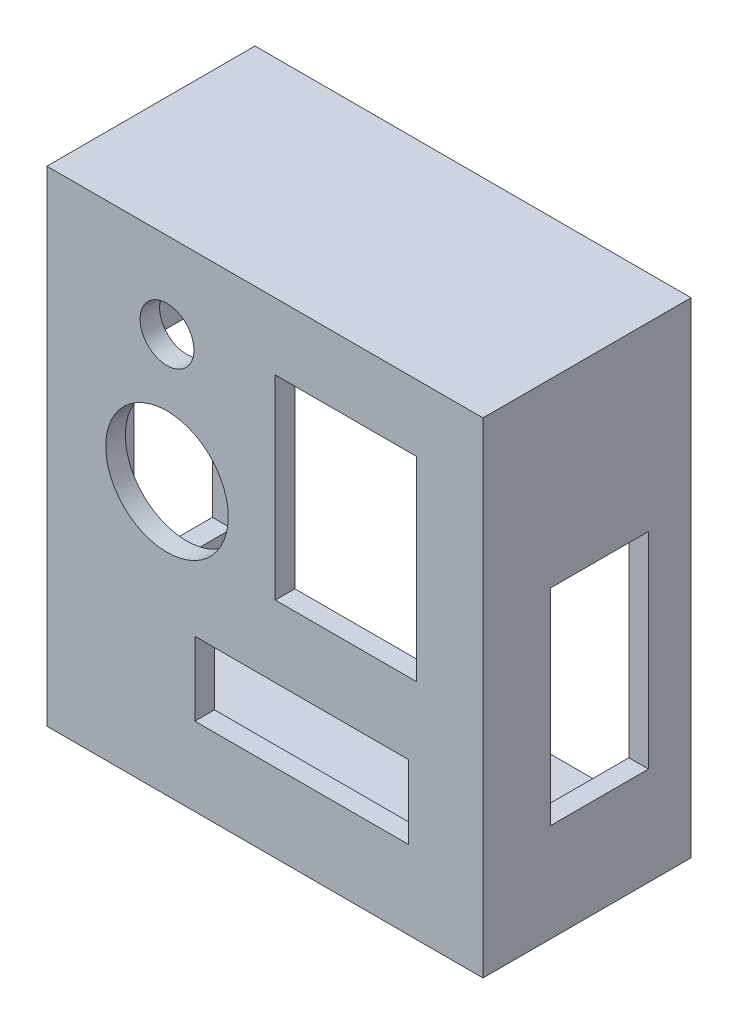
ISO-10303-21;
HEADER;
FILE_DESCRIPTION(('STEP AP214'),'2;1');
FILE_NAME('part.step','',(''),(''),'','','');
FILE_SCHEMA(('AUTOMOTIVE_DESIGN { 1 0 10303 214 1 1 1 1 }'));
ENDSEC;
DATA;
#1=APPLICATION_CONTEXT('core data for automotive mechanical design processes');
#2=APPLICATION_PROTOCOL_DEFINITION('international standard','automotive_design',2000,#1);
#3=PRODUCT_CONTEXT('',#1,'mechanical');
#4=PRODUCT('Part','Part','',(#3));
#5=PRODUCT_RELATED_PRODUCT_CATEGORY('part','',(#4));
#6=PRODUCT_DEFINITION_FORMATION('','',#4);
#7=PRODUCT_DEFINITION_CONTEXT('part definition',#1,'design');
#8=PRODUCT_DEFINITION('design','',#6,#7);
#9=PRODUCT_DEFINITION_SHAPE('','',#8);
#10=(LENGTH_UNIT() NAMED_UNIT(*) SI_UNIT(.MILLI.,.METRE.));
#11=(NAMED_UNIT(*) PLANE_ANGLE_UNIT() SI_UNIT($,.RADIAN.));
#12=(NAMED_UNIT(*) SI_UNIT($,.STERADIAN.) SOLID_ANGLE_UNIT());
#13=UNCERTAINTY_MEASURE_WITH_UNIT(LENGTH_MEASURE(1.E-05),#10,'distance_accuracy_value','');
#14=(GEOMETRIC_REPRESENTATION_CONTEXT(3) GLOBAL_UNCERTAINTY_ASSIGNED_CONTEXT((#13)) GLOBAL_UNIT_ASSIGNED_CONTEXT((#10,
#11,#12)) REPRESENTATION_CONTEXT('',''));
#15=CARTESIAN_POINT('',(0.,0.,0.));
#16=DIRECTION('',(0.,0.,1.));
#17=DIRECTION('',(1.,0.,0.));
#18=AXIS2_PLACEMENT_3D('',#15,#16,#17);
#19=CARTESIAN_POINT('',(-70.64375,-72.23125,-61.07176));
#20=DIRECTION('',(1.,0.,0.));
#21=DIRECTION('',(0.,0.,-1.));
#22=AXIS2_PLACEMENT_3D('',#19,#20,#21);
#23=PLANE('',#22);
#24=DIRECTION('',(0.,0.,-1.));
#25=VECTOR('',#24,1.);
#26=CARTESIAN_POINT('',(-70.64375,-46.76775,-15.52194));
#27=LINE('',#26,#25);
#28=CARTESIAN_POINT('',(-70.64375,-46.76775,-15.52194));
#29=VERTEX_POINT('',#28);
#30=CARTESIAN_POINT('',(-70.64375,-46.76775,-47.27194));
#31=VERTEX_POINT('',#30);
#32=EDGE_CURVE('E230',#29,#31,#27,.T.);
#33=ORIENTED_EDGE('',*,*,#32,.T.);
#34=DIRECTION('',(0.,1.,0.));
#35=VECTOR('',#34,1.);
#36=CARTESIAN_POINT('',(-70.64375,19.90725,-47.27194));
#37=LINE('',#36,#35);
#38=CARTESIAN_POINT('',(-70.64375,19.90725,-47.27194));
#39=VERTEX_POINT('',#38);
#40=EDGE_CURVE('E211',#31,#39,#37,.T.);
#41=ORIENTED_EDGE('',*,*,#40,.T.);
#42=DIRECTION('',(0.,0.,1.));
#43=VECTOR('',#42,1.);
#44=CARTESIAN_POINT('',(-70.64375,19.90725,-15.52194));
#45=LINE('',#44,#43);
#46=CARTESIAN_POINT('',(-70.64375,19.90725,-15.52194));
#47=VERTEX_POINT('',#46);
#48=EDGE_CURVE('E222',#39,#47,#45,.T.);
#49=ORIENTED_EDGE('',*,*,#48,.T.);
#50=DIRECTION('',(0.,-1.,0.));
#51=VECTOR('',#50,1.);
#52=CARTESIAN_POINT('',(-70.64375,19.90725,-15.52194));
#53=LINE('',#52,#51);
#54=EDGE_CURVE('E58',#47,#29,#53,.T.);
#55=ORIENTED_EDGE('',*,*,#54,.T.);
#56=EDGE_LOOP('',(#33,#41,#49,#55));
#57=FACE_BOUND('',#56,.T.);
#58=DIRECTION('',(0.,1.,0.));
#59=VECTOR('',#58,1.);
#60=CARTESIAN_POINT('',(-70.64375,-72.23125,6.35));
#61=LINE('',#60,#59);
#62=CARTESIAN_POINT('',(-70.64375,-78.58125,6.35));
#63=VERTEX_POINT('',#62);
#64=CARTESIAN_POINT('',(-70.64375,78.58125,6.35));
#65=VERTEX_POINT('',#64);
#66=EDGE_CURVE('E383',#63,#65,#61,.T.);
#67=ORIENTED_EDGE('',*,*,#66,.T.);
#68=DIRECTION('',(0.,0.,1.));
#69=VECTOR('',#68,1.);
#70=CARTESIAN_POINT('',(-70.64375,78.58125,-61.07176));
#71=LINE('',#70,#69);
#72=CARTESIAN_POINT('',(-70.64375,78.58125,-61.07176));
#73=VERTEX_POINT('',#72);
#74=EDGE_CURVE('E388',#73,#65,#71,.T.);
#75=ORIENTED_EDGE('',*,*,#74,.F.);
#76=DIRECTION('',(0.,1.,0.));
#77=VECTOR('',#76,1.);
#78=CARTESIAN_POINT('',(-70.64375,-72.23125,-61.07176));
#79=LINE('',#78,#77);
#80=CARTESIAN_POINT('',(-70.64375,-78.58125,-61.07176));
#81=VERTEX_POINT('',#80);
#82=EDGE_CURVE('E414',#81,#73,#79,.T.);
#83=ORIENTED_EDGE('',*,*,#82,.F.);
#84=DIRECTION('',(0.,0.,1.));
#85=VECTOR('',#84,1.);
#86=CARTESIAN_POINT('',(-70.64375,-78.58125,-61.07176));
#87=LINE('',#86,#85);
#88=EDGE_CURVE('E394',#81,#63,#87,.T.);
#89=ORIENTED_EDGE('',*,*,#88,.T.);
#90=EDGE_LOOP('',(#67,#75,#83,#89));
#91=FACE_BOUND('',#90,.T.);
#92=ADVANCED_FACE('F42',(#57,#91),#23,.F.);
#93=CARTESIAN_POINT('',(-64.29375,78.58125,-61.07176));
#94=DIRECTION('',(0.,-1.,0.));
#95=DIRECTION('',(0.,0.,-1.));
#96=AXIS2_PLACEMENT_3D('',#93,#94,#95);
#97=PLANE('',#96);
#98=DIRECTION('',(1.,0.,0.));
#99=VECTOR('',#98,1.);
#100=CARTESIAN_POINT('',(-64.29375,78.58125,6.35));
#101=LINE('',#100,#99);
#102=CARTESIAN_POINT('',(70.64375,78.58125,6.35));
#103=VERTEX_POINT('',#102);
#104=EDGE_CURVE('E387',#65,#103,#101,.T.);
#105=ORIENTED_EDGE('',*,*,#104,.T.);
#106=DIRECTION('',(0.,0.,1.));
#107=VECTOR('',#106,1.);
#108=CARTESIAN_POINT('',(70.64375,78.58125,-61.07176));
#109=LINE('',#108,#107);
#110=CARTESIAN_POINT('',(70.64375,78.58125,-61.07176));
#111=VERTEX_POINT('',#110);
#112=EDGE_CURVE('E393',#111,#103,#109,.T.);
#113=ORIENTED_EDGE('',*,*,#112,.F.);
#114=DIRECTION('',(1.,0.,0.));
#115=VECTOR('',#114,1.);
#116=CARTESIAN_POINT('',(-64.29375,78.58125,-61.07176));
#117=LINE('',#116,#115);
#118=EDGE_CURVE('E418',#73,#111,#117,.T.);
#119=ORIENTED_EDGE('',*,*,#118,.F.);
#120=ORIENTED_EDGE('',*,*,#74,.T.);
#121=EDGE_LOOP('',(#105,#113,#119,#120));
#122=FACE_BOUND('',#121,.T.);
#123=ADVANCED_FACE('F492',(#122),#97,.F.);
#124=CARTESIAN_POINT('',(70.64375,-72.23125,-61.07176));
#125=DIRECTION('',(1.,0.,0.));
#126=DIRECTION('',(0.,0.,-1.));
#127=AXIS2_PLACEMENT_3D('',#124,#125,#126);
#128=PLANE('',#127);
#129=DIRECTION('',(0.,1.,0.));
#130=VECTOR('',#129,1.);
#131=CARTESIAN_POINT('',(70.64375,19.90725,-47.27194));
#132=LINE('',#131,#130);
#133=CARTESIAN_POINT('',(70.64375,-46.76775,-47.27194));
#134=VERTEX_POINT('',#133);
#135=CARTESIAN_POINT('',(70.64375,19.90725,-47.27194));
#136=VERTEX_POINT('',#135);
#137=EDGE_CURVE('E66',#134,#136,#132,.T.);
#138=ORIENTED_EDGE('',*,*,#137,.F.);
#139=DIRECTION('',(0.,0.,-1.));
#140=VECTOR('',#139,1.);
#141=CARTESIAN_POINT('',(70.64375,-46.76775,-15.52194));
#142=LINE('',#141,#140);
#143=CARTESIAN_POINT('',(70.64375,-46.76775,-15.52194));
#144=VERTEX_POINT('',#143);
#145=EDGE_CURVE('E232',#144,#134,#142,.T.);
#146=ORIENTED_EDGE('',*,*,#145,.F.);
#147=DIRECTION('',(0.,-1.,0.));
#148=VECTOR('',#147,1.);
#149=CARTESIAN_POINT('',(70.64375,19.90725,-15.52194));
#150=LINE('',#149,#148);
#151=CARTESIAN_POINT('',(70.64375,19.90725,-15.52194));
#152=VERTEX_POINT('',#151);
#153=EDGE_CURVE('E236',#152,#144,#150,.T.);
#154=ORIENTED_EDGE('',*,*,#153,.F.);
#155=DIRECTION('',(0.,0.,1.));
#156=VECTOR('',#155,1.);
#157=CARTESIAN_POINT('',(70.64375,19.90725,-15.52194));
#158=LINE('',#157,#156);
#159=EDGE_CURVE('E245',#136,#152,#158,.T.);
#160=ORIENTED_EDGE('',*,*,#159,.F.);
#161=EDGE_LOOP('',(#138,#146,#154,#160));
#162=FACE_BOUND('',#161,.T.);
#163=DIRECTION('',(0.,1.,0.));
#164=VECTOR('',#163,1.);
#165=CARTESIAN_POINT('',(70.64375,-72.23125,6.35));
#166=LINE('',#165,#164);
#167=CARTESIAN_POINT('',(70.64375,-78.58125,6.35));
#168=VERTEX_POINT('',#167);
#169=EDGE_CURVE('E402',#168,#103,#166,.T.);
#170=ORIENTED_EDGE('',*,*,#169,.F.);
#171=DIRECTION('',(0.,0.,1.));
#172=VECTOR('',#171,1.);
#173=CARTESIAN_POINT('',(70.64375,-78.58125,-61.07176));
#174=LINE('',#173,#172);
#175=CARTESIAN_POINT('',(70.64375,-78.58125,-61.07176));
#176=VERTEX_POINT('',#175);
#177=EDGE_CURVE('E397',#176,#168,#174,.T.);
#178=ORIENTED_EDGE('',*,*,#177,.F.);
#179=DIRECTION('',(0.,1.,0.));
#180=VECTOR('',#179,1.);
#181=CARTESIAN_POINT('',(70.64375,-72.23125,-61.07176));
#182=LINE('',#181,#180);
#183=EDGE_CURVE('E421',#176,#111,#182,.T.);
#184=ORIENTED_EDGE('',*,*,#183,.T.);
#185=ORIENTED_EDGE('',*,*,#112,.T.);
#186=EDGE_LOOP('',(#170,#178,#184,#185));
#187=FACE_BOUND('',#186,.T.);
#188=ADVANCED_FACE('F488',(#162,#187),#128,.T.);
#189=CARTESIAN_POINT('',(-64.29375,-78.58125,-61.07176));
#190=DIRECTION('',(0.,-1.,0.));
#191=DIRECTION('',(0.,0.,-1.));
#192=AXIS2_PLACEMENT_3D('',#189,#190,#191);
#193=PLANE('',#192);
#194=DIRECTION('',(1.,0.,0.));
#195=VECTOR('',#194,1.);
#196=CARTESIAN_POINT('',(-64.29375,-78.58125,6.35));
#197=LINE('',#196,#195);
#198=EDGE_CURVE('E408',#63,#168,#197,.T.);
#199=ORIENTED_EDGE('',*,*,#198,.F.);
#200=ORIENTED_EDGE('',*,*,#88,.F.);
#201=DIRECTION('',(1.,0.,0.));
#202=VECTOR('',#201,1.);
#203=CARTESIAN_POINT('',(-64.29375,-78.58125,-61.07176));
#204=LINE('',#203,#202);
#205=EDGE_CURVE('E398',#81,#176,#204,.T.);
#206=ORIENTED_EDGE('',*,*,#205,.T.);
#207=ORIENTED_EDGE('',*,*,#177,.T.);
#208=EDGE_LOOP('',(#199,#200,#206,#207));
#209=FACE_BOUND('',#208,.T.);
#210=ADVANCED_FACE('F491',(#209),#193,.T.);
#211=CARTESIAN_POINT('',(0.,0.,-61.07176));
#212=DIRECTION('',(0.,0.,-1.));
#213=DIRECTION('',(-1.,0.,0.));
#214=AXIS2_PLACEMENT_3D('',#211,#212,#213);
#215=PLANE('',#214);
#216=DIRECTION('',(0.,1.,0.));
#217=VECTOR('',#216,1.);
#218=CARTESIAN_POINT('',(-64.29375,-72.23125,-61.07176));
#219=LINE('',#218,#217);
#220=CARTESIAN_POINT('',(-64.29375,-72.23125,-61.07176));
#221=VERTEX_POINT('',#220);
#222=CARTESIAN_POINT('',(-64.29375,72.23125,-61.07176));
#223=VERTEX_POINT('',#222);
#224=EDGE_CURVE('E339',#221,#223,#219,.T.);
#225=ORIENTED_EDGE('',*,*,#224,.F.);
#226=DIRECTION('',(1.,0.,0.));
#227=VECTOR('',#226,1.);
#228=CARTESIAN_POINT('',(-64.29375,-72.23125,-61.07176));
#229=LINE('',#228,#227);
#230=CARTESIAN_POINT('',(64.29375,-72.23125,-61.07176));
#231=VERTEX_POINT('',#230);
#232=EDGE_CURVE('E350',#221,#231,#229,.T.);
#233=ORIENTED_EDGE('',*,*,#232,.T.);
#234=DIRECTION('',(0.,1.,0.));
#235=VECTOR('',#234,1.);
#236=CARTESIAN_POINT('',(64.29375,-72.23125,-61.07176));
#237=LINE('',#236,#235);
#238=CARTESIAN_POINT('',(64.29375,72.23125,-61.07176));
#239=VERTEX_POINT('',#238);
#240=EDGE_CURVE('E346',#231,#239,#237,.T.);
#241=ORIENTED_EDGE('',*,*,#240,.T.);
#242=DIRECTION('',(1.,0.,0.));
#243=VECTOR('',#242,1.);
#244=CARTESIAN_POINT('',(-64.29375,72.23125,-61.07176));
#245=LINE('',#244,#243);
#246=EDGE_CURVE('E342',#223,#239,#245,.T.);
#247=ORIENTED_EDGE('',*,*,#246,.F.);
#248=EDGE_LOOP('',(#225,#233,#241,#247));
#249=FACE_BOUND('',#248,.T.);
#250=ORIENTED_EDGE('',*,*,#82,.T.);
#251=ORIENTED_EDGE('',*,*,#118,.T.);
#252=ORIENTED_EDGE('',*,*,#183,.F.);
#253=ORIENTED_EDGE('',*,*,#205,.F.);
#254=EDGE_LOOP('',(#250,#251,#252,#253));
#255=FACE_BOUND('',#254,.T.);
#256=ADVANCED_FACE('F504',(#249,#255),#215,.T.);
#257=CARTESIAN_POINT('',(0.,0.,6.35));
#258=DIRECTION('',(0.,0.,-1.));
#259=DIRECTION('',(-1.,0.,0.));
#260=AXIS2_PLACEMENT_3D('',#257,#258,#259);
#261=PLANE('',#260);
#262=DIRECTION('',(-1.,0.,0.));
#263=VECTOR('',#262,1.);
#264=CARTESIAN_POINT('',(-22.70125,-29.36875,6.35));
#265=LINE('',#264,#263);
#266=CARTESIAN_POINT('',(46.51375,-29.36875,6.35));
#267=VERTEX_POINT('',#266);
#268=CARTESIAN_POINT('',(-22.70125,-29.36875,6.35));
#269=VERTEX_POINT('',#268);
#270=EDGE_CURVE('E329',#267,#269,#265,.T.);
#271=ORIENTED_EDGE('',*,*,#270,.F.);
#272=DIRECTION('',(0.,1.,0.));
#273=VECTOR('',#272,1.);
#274=CARTESIAN_POINT('',(46.51375,-29.36875,6.35));
#275=LINE('',#274,#273);
#276=CARTESIAN_POINT('',(46.51375,-53.18125,6.35));
#277=VERTEX_POINT('',#276);
#278=EDGE_CURVE('E295',#277,#267,#275,.T.);
#279=ORIENTED_EDGE('',*,*,#278,.F.);
#280=DIRECTION('',(1.,0.,0.));
#281=VECTOR('',#280,1.);
#282=CARTESIAN_POINT('',(-22.70125,-53.18125,6.35));
#283=LINE('',#282,#281);
#284=CARTESIAN_POINT('',(-22.70125,-53.18125,6.35));
#285=VERTEX_POINT('',#284);
#286=EDGE_CURVE('E313',#285,#277,#283,.T.);
#287=ORIENTED_EDGE('',*,*,#286,.F.);
#288=DIRECTION('',(0.,-1.,0.));
#289=VECTOR('',#288,1.);
#290=CARTESIAN_POINT('',(-22.70125,-29.36875,6.35));
#291=LINE('',#290,#289);
#292=EDGE_CURVE('E325',#269,#285,#291,.T.);
#293=ORIENTED_EDGE('',*,*,#292,.F.);
#294=EDGE_LOOP('',(#271,#279,#287,#293));
#295=FACE_BOUND('',#294,.T.);
#296=DIRECTION('',(-1.,0.,0.));
#297=VECTOR('',#296,1.);
#298=CARTESIAN_POINT('',(3.33374999999998,56.99125,6.35));
#299=LINE('',#298,#297);
#300=CARTESIAN_POINT('',(49.05375,56.99125,6.35));
#301=VERTEX_POINT('',#300);
#302=CARTESIAN_POINT('',(3.33374999999998,56.99125,6.35));
#303=VERTEX_POINT('',#302);
#304=EDGE_CURVE('E303',#301,#303,#299,.T.);
#305=ORIENTED_EDGE('',*,*,#304,.F.);
#306=DIRECTION('',(0.,1.,0.));
#307=VECTOR('',#306,1.);
#308=CARTESIAN_POINT('',(49.05375,56.99125,6.35));
#309=LINE('',#308,#307);
#310=CARTESIAN_POINT('',(49.05375,-6.19125,6.35));
#311=VERTEX_POINT('',#310);
#312=EDGE_CURVE('E280',#311,#301,#309,.T.);
#313=ORIENTED_EDGE('',*,*,#312,.F.);
#314=DIRECTION('',(1.,0.,0.));
#315=VECTOR('',#314,1.);
#316=CARTESIAN_POINT('',(3.33374999999999,-6.19125,6.35));
#317=LINE('',#316,#315);
#318=CARTESIAN_POINT('',(3.33374999999999,-6.19125,6.35));
#319=VERTEX_POINT('',#318);
#320=EDGE_CURVE('E285',#319,#311,#317,.T.);
#321=ORIENTED_EDGE('',*,*,#320,.F.);
#322=DIRECTION('',(0.,-1.,0.));
#323=VECTOR('',#322,1.);
#324=CARTESIAN_POINT('',(3.33374999999998,56.99125,6.35));
#325=LINE('',#324,#323);
#326=EDGE_CURVE('E299',#303,#319,#325,.T.);
#327=ORIENTED_EDGE('',*,*,#326,.F.);
#328=EDGE_LOOP('',(#305,#313,#321,#327));
#329=FACE_BOUND('',#328,.T.);
#330=CARTESIAN_POINT('',(-31.75,9.52499999999999,6.35));
#331=DIRECTION('',(0.,0.,1.));
#332=DIRECTION('',(1.,0.,0.));
#333=AXIS2_PLACEMENT_3D('',#330,#331,#332);
#334=CIRCLE('',#333,19.84375);
#335=CARTESIAN_POINT('',(-11.90625,9.52499999999999,6.34999999999999));
#336=VERTEX_POINT('',#335);
#337=EDGE_CURVE('E275',#336,#336,#334,.T.);
#338=ORIENTED_EDGE('',*,*,#337,.F.);
#339=EDGE_LOOP('',(#338));
#340=FACE_BOUND('',#339,.T.);
#341=CARTESIAN_POINT('',(-31.75,50.8,6.35));
#342=DIRECTION('',(0.,0.,1.));
#343=DIRECTION('',(1.,0.,0.));
#344=AXIS2_PLACEMENT_3D('',#341,#342,#343);
#345=CIRCLE('',#344,8.73124999999999);
#346=CARTESIAN_POINT('',(-23.01875,50.8,6.34999999999999));
#347=VERTEX_POINT('',#346);
#348=EDGE_CURVE('E279',#347,#347,#345,.T.);
#349=ORIENTED_EDGE('',*,*,#348,.F.);
#350=EDGE_LOOP('',(#349));
#351=FACE_BOUND('',#350,.T.);
#352=ORIENTED_EDGE('',*,*,#66,.F.);
#353=ORIENTED_EDGE('',*,*,#198,.T.);
#354=ORIENTED_EDGE('',*,*,#169,.T.);
#355=ORIENTED_EDGE('',*,*,#104,.F.);
#356=EDGE_LOOP('',(#352,#353,#354,#355));
#357=FACE_BOUND('',#356,.T.);
#358=ADVANCED_FACE('F44',(#295,#329,#340,#351,#357),#261,.F.);
#359=CARTESIAN_POINT('',(-64.29375,-72.23125,-61.07176));
#360=DIRECTION('',(1.,0.,0.));
#361=DIRECTION('',(0.,0.,-1.));
#362=AXIS2_PLACEMENT_3D('',#359,#360,#361);
#363=PLANE('',#362);
#364=DIRECTION('',(0.,1.,0.));
#365=VECTOR('',#364,1.);
#366=CARTESIAN_POINT('',(-64.29375,-72.23125,-47.27194));
#367=LINE('',#366,#365);
#368=CARTESIAN_POINT('',(-64.29375,-46.76775,-47.27194));
#369=VERTEX_POINT('',#368);
#370=CARTESIAN_POINT('',(-64.29375,19.90725,-47.27194));
#371=VERTEX_POINT('',#370);
#372=EDGE_CURVE('E214',#369,#371,#367,.T.);
#373=ORIENTED_EDGE('',*,*,#372,.F.);
#374=DIRECTION('',(0.,0.,-1.));
#375=VECTOR('',#374,1.);
#376=CARTESIAN_POINT('',(-64.29375,-46.76775,-61.07176));
#377=LINE('',#376,#375);
#378=CARTESIAN_POINT('',(-64.29375,-46.76775,-15.52194));
#379=VERTEX_POINT('',#378);
#380=EDGE_CURVE('E269',#379,#369,#377,.T.);
#381=ORIENTED_EDGE('',*,*,#380,.F.);
#382=DIRECTION('',(0.,-1.,0.));
#383=VECTOR('',#382,1.);
#384=CARTESIAN_POINT('',(-64.29375,-72.23125,-15.52194));
#385=LINE('',#384,#383);
#386=CARTESIAN_POINT('',(-64.29375,19.90725,-15.52194));
#387=VERTEX_POINT('',#386);
#388=EDGE_CURVE('E266',#387,#379,#385,.T.);
#389=ORIENTED_EDGE('',*,*,#388,.F.);
#390=DIRECTION('',(0.,0.,1.));
#391=VECTOR('',#390,1.);
#392=CARTESIAN_POINT('',(-64.29375,19.90725,-61.07176));
#393=LINE('',#392,#391);
#394=EDGE_CURVE('E255',#371,#387,#393,.T.);
#395=ORIENTED_EDGE('',*,*,#394,.F.);
#396=EDGE_LOOP('',(#373,#381,#389,#395));
#397=FACE_BOUND('',#396,.T.);
#398=DIRECTION('',(0.,1.,0.));
#399=VECTOR('',#398,1.);
#400=CARTESIAN_POINT('',(-64.29375,-72.23125,0.));
#401=LINE('',#400,#399);
#402=CARTESIAN_POINT('',(-64.29375,-72.23125,0.));
#403=VERTEX_POINT('',#402);
#404=CARTESIAN_POINT('',(-64.29375,72.23125,0.));
#405=VERTEX_POINT('',#404);
#406=EDGE_CURVE('E355',#403,#405,#401,.T.);
#407=ORIENTED_EDGE('',*,*,#406,.F.);
#408=DIRECTION('',(0.,0.,1.));
#409=VECTOR('',#408,1.);
#410=CARTESIAN_POINT('',(-64.29375,-72.23125,-61.07176));
#411=LINE('',#410,#409);
#412=EDGE_CURVE('E354',#221,#403,#411,.T.);
#413=ORIENTED_EDGE('',*,*,#412,.F.);
#414=ORIENTED_EDGE('',*,*,#224,.T.);
#415=DIRECTION('',(0.,0.,1.));
#416=VECTOR('',#415,1.);
#417=CARTESIAN_POINT('',(-64.29375,72.23125,-61.07176));
#418=LINE('',#417,#416);
#419=EDGE_CURVE('E379',#223,#405,#418,.T.);
#420=ORIENTED_EDGE('',*,*,#419,.T.);
#421=EDGE_LOOP('',(#407,#413,#414,#420));
#422=FACE_BOUND('',#421,.T.);
#423=ADVANCED_FACE('F523',(#397,#422),#363,.T.);
#424=CARTESIAN_POINT('',(-64.29375,72.23125,-61.07176));
#425=DIRECTION('',(0.,-1.,0.));
#426=DIRECTION('',(0.,0.,-1.));
#427=AXIS2_PLACEMENT_3D('',#424,#425,#426);
#428=PLANE('',#427);
#429=DIRECTION('',(1.,0.,0.));
#430=VECTOR('',#429,1.);
#431=CARTESIAN_POINT('',(-64.29375,72.23125,0.));
#432=LINE('',#431,#430);
#433=CARTESIAN_POINT('',(64.29375,72.23125,0.));
#434=VERTEX_POINT('',#433);
#435=EDGE_CURVE('E359',#405,#434,#432,.T.);
#436=ORIENTED_EDGE('',*,*,#435,.F.);
#437=ORIENTED_EDGE('',*,*,#419,.F.);
#438=ORIENTED_EDGE('',*,*,#246,.T.);
#439=DIRECTION('',(0.,0.,1.));
#440=VECTOR('',#439,1.);
#441=CARTESIAN_POINT('',(64.29375,72.23125,-61.07176));
#442=LINE('',#441,#440);
#443=EDGE_CURVE('E376',#239,#434,#442,.T.);
#444=ORIENTED_EDGE('',*,*,#443,.T.);
#445=EDGE_LOOP('',(#436,#437,#438,#444));
#446=FACE_BOUND('',#445,.T.);
#447=ADVANCED_FACE('F532',(#446),#428,.T.);
#448=CARTESIAN_POINT('',(64.29375,-72.23125,-61.07176));
#449=DIRECTION('',(1.,0.,0.));
#450=DIRECTION('',(0.,0.,-1.));
#451=AXIS2_PLACEMENT_3D('',#448,#449,#450);
#452=PLANE('',#451);
#453=DIRECTION('',(0.,0.,-1.));
#454=VECTOR('',#453,1.);
#455=CARTESIAN_POINT('',(64.29375,-46.76775,-61.07176));
#456=LINE('',#455,#454);
#457=CARTESIAN_POINT('',(64.29375,-46.76775,-15.52194));
#458=VERTEX_POINT('',#457);
#459=CARTESIAN_POINT('',(64.29375,-46.76775,-47.27194));
#460=VERTEX_POINT('',#459);
#461=EDGE_CURVE('E51',#458,#460,#456,.T.);
#462=ORIENTED_EDGE('',*,*,#461,.T.);
#463=DIRECTION('',(0.,1.,0.));
#464=VECTOR('',#463,1.);
#465=CARTESIAN_POINT('',(64.29375,-72.23125,-47.27194));
#466=LINE('',#465,#464);
#467=CARTESIAN_POINT('',(64.29375,19.90725,-47.27194));
#468=VERTEX_POINT('',#467);
#469=EDGE_CURVE('E11',#460,#468,#466,.T.);
#470=ORIENTED_EDGE('',*,*,#469,.T.);
#471=DIRECTION('',(0.,0.,1.));
#472=VECTOR('',#471,1.);
#473=CARTESIAN_POINT('',(64.29375,19.90725,-61.07176));
#474=LINE('',#473,#472);
#475=CARTESIAN_POINT('',(64.29375,19.90725,-15.52194));
#476=VERTEX_POINT('',#475);
#477=EDGE_CURVE('E459',#468,#476,#474,.T.);
#478=ORIENTED_EDGE('',*,*,#477,.T.);
#479=DIRECTION('',(0.,-1.,0.));
#480=VECTOR('',#479,1.);
#481=CARTESIAN_POINT('',(64.29375,-72.23125,-15.52194));
#482=LINE('',#481,#480);
#483=EDGE_CURVE('E463',#476,#458,#482,.T.);
#484=ORIENTED_EDGE('',*,*,#483,.T.);
#485=EDGE_LOOP('',(#462,#470,#478,#484));
#486=FACE_BOUND('',#485,.T.);
#487=DIRECTION('',(0.,1.,0.));
#488=VECTOR('',#487,1.);
#489=CARTESIAN_POINT('',(64.29375,-72.23125,0.));
#490=LINE('',#489,#488);
#491=CARTESIAN_POINT('',(64.29375,-72.23125,0.));
#492=VERTEX_POINT('',#491);
#493=EDGE_CURVE('E364',#492,#434,#490,.T.);
#494=ORIENTED_EDGE('',*,*,#493,.T.);
#495=ORIENTED_EDGE('',*,*,#443,.F.);
#496=ORIENTED_EDGE('',*,*,#240,.F.);
#497=DIRECTION('',(0.,0.,1.));
#498=VECTOR('',#497,1.);
#499=CARTESIAN_POINT('',(64.29375,-72.23125,-61.07176));
#500=LINE('',#499,#498);
#501=EDGE_CURVE('E373',#231,#492,#500,.T.);
#502=ORIENTED_EDGE('',*,*,#501,.T.);
#503=EDGE_LOOP('',(#494,#495,#496,#502));
#504=FACE_BOUND('',#503,.T.);
#505=ADVANCED_FACE('F469',(#486,#504),#452,.F.);
#506=CARTESIAN_POINT('',(-64.29375,-72.23125,-61.07176));
#507=DIRECTION('',(0.,-1.,0.));
#508=DIRECTION('',(0.,0.,-1.));
#509=AXIS2_PLACEMENT_3D('',#506,#507,#508);
#510=PLANE('',#509);
#511=DIRECTION('',(1.,0.,0.));
#512=VECTOR('',#511,1.);
#513=CARTESIAN_POINT('',(-64.29375,-72.23125,0.));
#514=LINE('',#513,#512);
#515=EDGE_CURVE('E343',#403,#492,#514,.T.);
#516=ORIENTED_EDGE('',*,*,#515,.T.);
#517=ORIENTED_EDGE('',*,*,#501,.F.);
#518=ORIENTED_EDGE('',*,*,#232,.F.);
#519=ORIENTED_EDGE('',*,*,#412,.T.);
#520=EDGE_LOOP('',(#516,#517,#518,#519));
#521=FACE_BOUND('',#520,.T.);
#522=ADVANCED_FACE('F540',(#521),#510,.F.);
#523=CARTESIAN_POINT('',(0.,0.,0.));
#524=DIRECTION('',(0.,0.,-1.));
#525=DIRECTION('',(-1.,0.,0.));
#526=AXIS2_PLACEMENT_3D('',#523,#524,#525);
#527=PLANE('',#526);
#528=DIRECTION('',(0.,-1.,0.));
#529=VECTOR('',#528,1.);
#530=CARTESIAN_POINT('',(46.51375,0.,0.));
#531=LINE('',#530,#529);
#532=CARTESIAN_POINT('',(46.51375,-29.36875,0.));
#533=VERTEX_POINT('',#532);
#534=CARTESIAN_POINT('',(46.51375,-53.18125,0.));
#535=VERTEX_POINT('',#534);
#536=EDGE_CURVE('E456',#533,#535,#531,.T.);
#537=ORIENTED_EDGE('',*,*,#536,.F.);
#538=DIRECTION('',(1.,0.,0.));
#539=VECTOR('',#538,1.);
#540=CARTESIAN_POINT('',(0.,-29.36875,0.));
#541=LINE('',#540,#539);
#542=CARTESIAN_POINT('',(-22.70125,-29.36875,0.));
#543=VERTEX_POINT('',#542);
#544=EDGE_CURVE('E446',#543,#533,#541,.T.);
#545=ORIENTED_EDGE('',*,*,#544,.F.);
#546=DIRECTION('',(0.,1.,0.));
#547=VECTOR('',#546,1.);
#548=CARTESIAN_POINT('',(-22.70125,0.,0.));
#549=LINE('',#548,#547);
#550=CARTESIAN_POINT('',(-22.70125,-53.18125,0.));
#551=VERTEX_POINT('',#550);
#552=EDGE_CURVE('E449',#551,#543,#549,.T.);
#553=ORIENTED_EDGE('',*,*,#552,.F.);
#554=DIRECTION('',(-1.,0.,0.));
#555=VECTOR('',#554,1.);
#556=CARTESIAN_POINT('',(0.,-53.18125,0.));
#557=LINE('',#556,#555);
#558=EDGE_CURVE('E453',#535,#551,#557,.T.);
#559=ORIENTED_EDGE('',*,*,#558,.F.);
#560=EDGE_LOOP('',(#537,#545,#553,#559));
#561=FACE_BOUND('',#560,.T.);
#562=DIRECTION('',(0.,-1.,0.));
#563=VECTOR('',#562,1.);
#564=CARTESIAN_POINT('',(49.05375,0.,0.));
#565=LINE('',#564,#563);
#566=CARTESIAN_POINT('',(49.05375,56.99125,0.));
#567=VERTEX_POINT('',#566);
#568=CARTESIAN_POINT('',(49.05375,-6.19125,0.));
#569=VERTEX_POINT('',#568);
#570=EDGE_CURVE('E443',#567,#569,#565,.T.);
#571=ORIENTED_EDGE('',*,*,#570,.F.);
#572=DIRECTION('',(1.,0.,0.));
#573=VECTOR('',#572,1.);
#574=CARTESIAN_POINT('',(0.,56.99125,0.));
#575=LINE('',#574,#573);
#576=CARTESIAN_POINT('',(3.33374999999998,56.99125,0.));
#577=VERTEX_POINT('',#576);
#578=EDGE_CURVE('E392',#577,#567,#575,.T.);
#579=ORIENTED_EDGE('',*,*,#578,.F.);
#580=DIRECTION('',(0.,1.,0.));
#581=VECTOR('',#580,1.);
#582=CARTESIAN_POINT('',(3.33374999999999,0.,0.));
#583=LINE('',#582,#581);
#584=CARTESIAN_POINT('',(3.33374999999999,-6.19125,0.));
#585=VERTEX_POINT('',#584);
#586=EDGE_CURVE('E436',#585,#577,#583,.T.);
#587=ORIENTED_EDGE('',*,*,#586,.F.);
#588=DIRECTION('',(-1.,0.,0.));
#589=VECTOR('',#588,1.);
#590=CARTESIAN_POINT('',(0.,-6.19125,0.));
#591=LINE('',#590,#589);
#592=EDGE_CURVE('E440',#569,#585,#591,.T.);
#593=ORIENTED_EDGE('',*,*,#592,.F.);
#594=EDGE_LOOP('',(#571,#579,#587,#593));
#595=FACE_BOUND('',#594,.T.);
#596=CARTESIAN_POINT('',(-31.75,9.52499999999999,0.));
#597=DIRECTION('',(0.,0.,-1.));
#598=DIRECTION('',(-1.,0.,0.));
#599=AXIS2_PLACEMENT_3D('',#596,#597,#598);
#600=CIRCLE('',#599,19.84375);
#601=CARTESIAN_POINT('',(-11.90625,9.52499999999999,0.));
#602=VERTEX_POINT('',#601);
#603=EDGE_CURVE('E360',#602,#602,#600,.T.);
#604=ORIENTED_EDGE('',*,*,#603,.F.);
#605=EDGE_LOOP('',(#604));
#606=FACE_BOUND('',#605,.T.);
#607=CARTESIAN_POINT('',(-31.75,50.8,0.));
#608=DIRECTION('',(0.,0.,-1.));
#609=DIRECTION('',(-1.,0.,0.));
#610=AXIS2_PLACEMENT_3D('',#607,#608,#609);
#611=CIRCLE('',#610,8.73124999999999);
#612=CARTESIAN_POINT('',(-23.01875,50.8,0.));
#613=VERTEX_POINT('',#612);
#614=EDGE_CURVE('E338',#613,#613,#611,.T.);
#615=ORIENTED_EDGE('',*,*,#614,.F.);
#616=EDGE_LOOP('',(#615));
#617=FACE_BOUND('',#616,.T.);
#618=ORIENTED_EDGE('',*,*,#406,.T.);
#619=ORIENTED_EDGE('',*,*,#435,.T.);
#620=ORIENTED_EDGE('',*,*,#493,.F.);
#621=ORIENTED_EDGE('',*,*,#515,.F.);
#622=EDGE_LOOP('',(#618,#619,#620,#621));
#623=FACE_BOUND('',#622,.T.);
#624=ADVANCED_FACE('F536',(#561,#595,#606,#617,#623),#527,.T.);
#625=CARTESIAN_POINT('',(-31.75,50.8,-61.07176));
#626=DIRECTION('',(0.,0.,1.));
#627=DIRECTION('',(1.,0.,0.));
#628=AXIS2_PLACEMENT_3D('',#625,#626,#627);
#629=CYLINDRICAL_SURFACE('',#628,8.73124999999999);
#630=CARTESIAN_POINT('',(-23.01875,50.8,0.));
#631=CARTESIAN_POINT('',(-23.01875,50.8,0.0661458333333341));
#632=CARTESIAN_POINT('',(-23.01875,50.8,0.132291666666668));
#633=CARTESIAN_POINT('',(-23.01875,50.8,0.264583333333334));
#634=CARTESIAN_POINT('',(-23.01875,50.8,0.330729166666666));
#635=CARTESIAN_POINT('',(-23.01875,50.8,0.463020833333332));
#636=CARTESIAN_POINT('',(-23.01875,50.8,0.529166666666666));
#637=CARTESIAN_POINT('',(-23.01875,50.8,0.661458333333332));
#638=CARTESIAN_POINT('',(-23.01875,50.8,0.727604166666664));
#639=CARTESIAN_POINT('',(-23.01875,50.8,0.85989583333333));
#640=CARTESIAN_POINT('',(-23.01875,50.8,0.926041666666664));
#641=CARTESIAN_POINT('',(-23.01875,50.8,1.05833333333333));
#642=CARTESIAN_POINT('',(-23.01875,50.8,1.12447916666667));
#643=CARTESIAN_POINT('',(-23.01875,50.8,1.25677083333333));
#644=CARTESIAN_POINT('',(-23.01875,50.8,1.32291666666666));
#645=CARTESIAN_POINT('',(-23.01875,50.8,1.45520833333333));
#646=CARTESIAN_POINT('',(-23.01875,50.8,1.52135416666666));
#647=CARTESIAN_POINT('',(-23.01875,50.8,1.65364583333332));
#648=CARTESIAN_POINT('',(-23.01875,50.8,1.71979166666666));
#649=CARTESIAN_POINT('',(-23.01875,50.8,1.85208333333333));
#650=CARTESIAN_POINT('',(-23.01875,50.8,1.91822916666666));
#651=CARTESIAN_POINT('',(-23.01875,50.8,2.05052083333332));
#652=CARTESIAN_POINT('',(-23.01875,50.8,2.11666666666665));
#653=CARTESIAN_POINT('',(-23.01875,50.8,2.24895833333332));
#654=CARTESIAN_POINT('',(-23.01875,50.8,2.31510416666666));
#655=CARTESIAN_POINT('',(-23.01875,50.8,2.44739583333333));
#656=CARTESIAN_POINT('',(-23.01875,50.8,2.51354166666666));
#657=CARTESIAN_POINT('',(-23.01875,50.8,2.64583333333332));
#658=CARTESIAN_POINT('',(-23.01875,50.8,2.71197916666665));
#659=CARTESIAN_POINT('',(-23.01875,50.8,2.84427083333332));
#660=CARTESIAN_POINT('',(-23.01875,50.8,2.91041666666666));
#661=CARTESIAN_POINT('',(-23.01875,50.8,3.04270833333333));
#662=CARTESIAN_POINT('',(-23.01875,50.8,3.10885416666666));
#663=CARTESIAN_POINT('',(-23.01875,50.8,3.24114583333332));
#664=CARTESIAN_POINT('',(-23.01875,50.8,3.30729166666665));
#665=CARTESIAN_POINT('',(-23.01875,50.8,3.43958333333332));
#666=CARTESIAN_POINT('',(-23.01875,50.8,3.50572916666666));
#667=CARTESIAN_POINT('',(-23.01875,50.8,3.63802083333333));
#668=CARTESIAN_POINT('',(-23.01875,50.8,3.70416666666666));
#669=CARTESIAN_POINT('',(-23.01875,50.8,3.83645833333332));
#670=CARTESIAN_POINT('',(-23.01875,50.8,3.90260416666665));
#671=CARTESIAN_POINT('',(-23.01875,50.8,4.03489583333332));
#672=CARTESIAN_POINT('',(-23.01875,50.8,4.10104166666666));
#673=CARTESIAN_POINT('',(-23.01875,50.8,4.23333333333333));
#674=CARTESIAN_POINT('',(-23.01875,50.8,4.29947916666666));
#675=CARTESIAN_POINT('',(-23.01875,50.8,4.43177083333332));
#676=CARTESIAN_POINT('',(-23.01875,50.8,4.49791666666665));
#677=CARTESIAN_POINT('',(-23.01875,50.8,4.63020833333332));
#678=CARTESIAN_POINT('',(-23.01875,50.8,4.69635416666666));
#679=CARTESIAN_POINT('',(-23.01875,50.8,4.82864583333333));
#680=CARTESIAN_POINT('',(-23.01875,50.8,4.89479166666666));
#681=CARTESIAN_POINT('',(-23.01875,50.8,5.02708333333332));
#682=CARTESIAN_POINT('',(-23.01875,50.8,5.09322916666665));
#683=CARTESIAN_POINT('',(-23.01875,50.8,5.22552083333332));
#684=CARTESIAN_POINT('',(-23.01875,50.8,5.29166666666665));
#685=CARTESIAN_POINT('',(-23.01875,50.8,5.42395833333332));
#686=CARTESIAN_POINT('',(-23.01875,50.8,5.49010416666666));
#687=CARTESIAN_POINT('',(-23.01875,50.8,5.62239583333332));
#688=CARTESIAN_POINT('',(-23.01875,50.8,5.68854166666666));
#689=CARTESIAN_POINT('',(-23.01875,50.8,5.82083333333332));
#690=CARTESIAN_POINT('',(-23.01875,50.8,5.88697916666665));
#691=CARTESIAN_POINT('',(-23.01875,50.8,6.01927083333332));
#692=CARTESIAN_POINT('',(-23.01875,50.8,6.08541666666666));
#693=CARTESIAN_POINT('',(-23.01875,50.8,6.21770833333332));
#694=CARTESIAN_POINT('',(-23.01875,50.8,6.28385416666666));
#695=CARTESIAN_POINT('',(-23.01875,50.8,6.34999999999999));
#696=B_SPLINE_CURVE_WITH_KNOTS('',3,(#630,#631,#632,#633,#634,#635,#636,#637,#638,#639,#640,
#641,#642,#643,#644,#645,#646,#647,#648,#649,#650,#651,#652,#653,#654,#655,#656,#657,#658,#659,
#660,#661,#662,#663,#664,#665,#666,#667,#668,#669,#670,#671,#672,#673,#674,#675,#676,#677,#678,
#679,#680,#681,#682,#683,#684,#685,#686,#687,#688,#689,#690,#691,#692,#693,#694,#695),
.UNSPECIFIED.,.F.,.F.,(4,2,2,2,2,2,2,2,2,2,2,2,2,2,2,2,2,2,2,2,2,2,2,2,2,2,2,2,2,2,2,2,4),(0.,
0.198437500000002,0.396874999999998,0.5953125,0.793749999999996,0.992187499999998,1.190625,
1.3890625,1.58749999999998,1.78593749999999,1.98437499999999,2.18281249999999,2.38124999999999,
2.57968749999999,2.77812499999999,2.97656249999999,3.17499999999999,3.37343749999999,3.571875,
3.77031249999999,3.96874999999999,4.1671875,4.36562499999999,4.56406249999999,4.7625,
4.96093749999999,5.15937499999999,5.35781249999998,5.55624999999999,5.75468749999999,
5.95312499999998,6.15156249999999,6.34999999999999),.UNSPECIFIED.);
#697=EDGE_CURVE('BSEAM547',#613,#347,#696,.T.);
#698=ORIENTED_EDGE('',*,*,#614,.T.);
#699=ORIENTED_EDGE('',*,*,#348,.T.);
#700=ORIENTED_EDGE('',*,*,#697,.T.);
#701=ORIENTED_EDGE('',*,*,#697,.F.);
#702=EDGE_LOOP('',(#698,#700,#699,#701));
#703=FACE_BOUND('',#702,.T.);
#704=ADVANCED_FACE('F547',(#703),#629,.F.);
#705=CARTESIAN_POINT('',(-31.75,9.52499999999999,-61.07176));
#706=DIRECTION('',(0.,0.,1.));
#707=DIRECTION('',(1.,0.,0.));
#708=AXIS2_PLACEMENT_3D('',#705,#706,#707);
#709=CYLINDRICAL_SURFACE('',#708,19.84375);
#710=CARTESIAN_POINT('',(-11.90625,9.52499999999999,0.));
#711=CARTESIAN_POINT('',(-11.90625,9.52499999999999,0.0661458333333341));
#712=CARTESIAN_POINT('',(-11.90625,9.52499999999999,0.132291666666668));
#713=CARTESIAN_POINT('',(-11.90625,9.52499999999999,0.264583333333334));
#714=CARTESIAN_POINT('',(-11.90625,9.52499999999999,0.330729166666666));
#715=CARTESIAN_POINT('',(-11.90625,9.52499999999999,0.463020833333332));
#716=CARTESIAN_POINT('',(-11.90625,9.52499999999999,0.529166666666666));
#717=CARTESIAN_POINT('',(-11.90625,9.52499999999999,0.661458333333332));
#718=CARTESIAN_POINT('',(-11.90625,9.52499999999999,0.727604166666664));
#719=CARTESIAN_POINT('',(-11.90625,9.52499999999999,0.85989583333333));
#720=CARTESIAN_POINT('',(-11.90625,9.52499999999999,0.926041666666664));
#721=CARTESIAN_POINT('',(-11.90625,9.52499999999999,1.05833333333333));
#722=CARTESIAN_POINT('',(-11.90625,9.52499999999999,1.12447916666667));
#723=CARTESIAN_POINT('',(-11.90625,9.52499999999999,1.25677083333333));
#724=CARTESIAN_POINT('',(-11.90625,9.52499999999999,1.32291666666666));
#725=CARTESIAN_POINT('',(-11.90625,9.52499999999999,1.45520833333333));
#726=CARTESIAN_POINT('',(-11.90625,9.52499999999999,1.52135416666666));
#727=CARTESIAN_POINT('',(-11.90625,9.52499999999999,1.65364583333332));
#728=CARTESIAN_POINT('',(-11.90625,9.52499999999999,1.71979166666666));
#729=CARTESIAN_POINT('',(-11.90625,9.52499999999999,1.85208333333333));
#730=CARTESIAN_POINT('',(-11.90625,9.52499999999999,1.91822916666666));
#731=CARTESIAN_POINT('',(-11.90625,9.52499999999999,2.05052083333332));
#732=CARTESIAN_POINT('',(-11.90625,9.52499999999999,2.11666666666665));
#733=CARTESIAN_POINT('',(-11.90625,9.52499999999999,2.24895833333332));
#734=CARTESIAN_POINT('',(-11.90625,9.52499999999999,2.31510416666666));
#735=CARTESIAN_POINT('',(-11.90625,9.52499999999999,2.44739583333333));
#736=CARTESIAN_POINT('',(-11.90625,9.52499999999999,2.51354166666666));
#737=CARTESIAN_POINT('',(-11.90625,9.52499999999999,2.64583333333332));
#738=CARTESIAN_POINT('',(-11.90625,9.52499999999999,2.71197916666665));
#739=CARTESIAN_POINT('',(-11.90625,9.52499999999999,2.84427083333332));
#740=CARTESIAN_POINT('',(-11.90625,9.52499999999999,2.91041666666666));
#741=CARTESIAN_POINT('',(-11.90625,9.52499999999999,3.04270833333333));
#742=CARTESIAN_POINT('',(-11.90625,9.52499999999999,3.10885416666666));
#743=CARTESIAN_POINT('',(-11.90625,9.52499999999999,3.24114583333332));
#744=CARTESIAN_POINT('',(-11.90625,9.52499999999999,3.30729166666665));
#745=CARTESIAN_POINT('',(-11.90625,9.52499999999999,3.43958333333332));
#746=CARTESIAN_POINT('',(-11.90625,9.52499999999999,3.50572916666666));
#747=CARTESIAN_POINT('',(-11.90625,9.52499999999999,3.63802083333333));
#748=CARTESIAN_POINT('',(-11.90625,9.52499999999999,3.70416666666666));
#749=CARTESIAN_POINT('',(-11.90625,9.52499999999999,3.83645833333332));
#750=CARTESIAN_POINT('',(-11.90625,9.52499999999999,3.90260416666665));
#751=CARTESIAN_POINT('',(-11.90625,9.52499999999999,4.03489583333332));
#752=CARTESIAN_POINT('',(-11.90625,9.52499999999999,4.10104166666666));
#753=CARTESIAN_POINT('',(-11.90625,9.52499999999999,4.23333333333333));
#754=CARTESIAN_POINT('',(-11.90625,9.52499999999999,4.29947916666666));
#755=CARTESIAN_POINT('',(-11.90625,9.52499999999999,4.43177083333332));
#756=CARTESIAN_POINT('',(-11.90625,9.52499999999999,4.49791666666665));
#757=CARTESIAN_POINT('',(-11.90625,9.52499999999999,4.63020833333332));
#758=CARTESIAN_POINT('',(-11.90625,9.52499999999999,4.69635416666666));
#759=CARTESIAN_POINT('',(-11.90625,9.52499999999999,4.82864583333333));
#760=CARTESIAN_POINT('',(-11.90625,9.52499999999999,4.89479166666666));
#761=CARTESIAN_POINT('',(-11.90625,9.52499999999999,5.02708333333332));
#762=CARTESIAN_POINT('',(-11.90625,9.52499999999999,5.09322916666665));
#763=CARTESIAN_POINT('',(-11.90625,9.52499999999999,5.22552083333332));
#764=CARTESIAN_POINT('',(-11.90625,9.52499999999999,5.29166666666665));
#765=CARTESIAN_POINT('',(-11.90625,9.52499999999999,5.42395833333332));
#766=CARTESIAN_POINT('',(-11.90625,9.52499999999999,5.49010416666666));
#767=CARTESIAN_POINT('',(-11.90625,9.52499999999999,5.62239583333332));
#768=CARTESIAN_POINT('',(-11.90625,9.52499999999999,5.68854166666666));
#769=CARTESIAN_POINT('',(-11.90625,9.52499999999999,5.82083333333332));
#770=CARTESIAN_POINT('',(-11.90625,9.52499999999999,5.88697916666665));
#771=CARTESIAN_POINT('',(-11.90625,9.52499999999999,6.01927083333332));
#772=CARTESIAN_POINT('',(-11.90625,9.52499999999999,6.08541666666666));
#773=CARTESIAN_POINT('',(-11.90625,9.52499999999999,6.21770833333332));
#774=CARTESIAN_POINT('',(-11.90625,9.52499999999999,6.28385416666666));
#775=CARTESIAN_POINT('',(-11.90625,9.52499999999999,6.34999999999999));
#776=B_SPLINE_CURVE_WITH_KNOTS('',3,(#710,#711,#712,#713,#714,#715,#716,#717,#718,#719,#720,
#721,#722,#723,#724,#725,#726,#727,#728,#729,#730,#731,#732,#733,#734,#735,#736,#737,#738,#739,
#740,#741,#742,#743,#744,#745,#746,#747,#748,#749,#750,#751,#752,#753,#754,#755,#756,#757,#758,
#759,#760,#761,#762,#763,#764,#765,#766,#767,#768,#769,#770,#771,#772,#773,#774,#775),
.UNSPECIFIED.,.F.,.F.,(4,2,2,2,2,2,2,2,2,2,2,2,2,2,2,2,2,2,2,2,2,2,2,2,2,2,2,2,2,2,2,2,4),(0.,
0.198437500000002,0.396874999999998,0.5953125,0.793749999999996,0.992187499999998,1.190625,
1.3890625,1.58749999999998,1.78593749999999,1.98437499999999,2.18281249999999,2.38124999999999,
2.57968749999999,2.77812499999999,2.97656249999999,3.17499999999999,3.37343749999999,3.571875,
3.77031249999999,3.96874999999999,4.1671875,4.36562499999999,4.56406249999999,4.7625,
4.96093749999999,5.15937499999999,5.35781249999998,5.55624999999999,5.75468749999999,
5.95312499999998,6.15156249999999,6.34999999999999),.UNSPECIFIED.);
#777=EDGE_CURVE('BSEAM584',#602,#336,#776,.T.);
#778=ORIENTED_EDGE('',*,*,#603,.T.);
#779=ORIENTED_EDGE('',*,*,#337,.T.);
#780=ORIENTED_EDGE('',*,*,#777,.T.);
#781=ORIENTED_EDGE('',*,*,#777,.F.);
#782=EDGE_LOOP('',(#778,#780,#779,#781));
#783=FACE_BOUND('',#782,.T.);
#784=ADVANCED_FACE('F584',(#783),#709,.F.);
#785=CARTESIAN_POINT('',(49.05375,56.99125,-61.07176));
#786=DIRECTION('',(1.,0.,0.));
#787=DIRECTION('',(0.,1.,0.));
#788=AXIS2_PLACEMENT_3D('',#785,#786,#787);
#789=PLANE('',#788);
#790=ORIENTED_EDGE('',*,*,#570,.T.);
#791=DIRECTION('',(0.,0.,1.));
#792=VECTOR('',#791,1.);
#793=CARTESIAN_POINT('',(49.05375,-6.19125,-61.07176));
#794=LINE('',#793,#792);
#795=EDGE_CURVE('E292',#569,#311,#794,.T.);
#796=ORIENTED_EDGE('',*,*,#795,.T.);
#797=ORIENTED_EDGE('',*,*,#312,.T.);
#798=DIRECTION('',(0.,0.,1.));
#799=VECTOR('',#798,1.);
#800=CARTESIAN_POINT('',(49.05375,56.99125,-61.07176));
#801=LINE('',#800,#799);
#802=EDGE_CURVE('E281',#567,#301,#801,.T.);
#803=ORIENTED_EDGE('',*,*,#802,.F.);
#804=EDGE_LOOP('',(#790,#796,#797,#803));
#805=FACE_BOUND('',#804,.T.);
#806=ADVANCED_FACE('F587',(#805),#789,.F.);
#807=CARTESIAN_POINT('',(3.33374999999999,-6.19125,-61.07176));
#808=DIRECTION('',(0.,-1.,0.));
#809=DIRECTION('',(0.,0.,-1.));
#810=AXIS2_PLACEMENT_3D('',#807,#808,#809);
#811=PLANE('',#810);
#812=ORIENTED_EDGE('',*,*,#592,.T.);
#813=DIRECTION('',(0.,0.,1.));
#814=VECTOR('',#813,1.);
#815=CARTESIAN_POINT('',(3.33374999999999,-6.19125,-61.07176));
#816=LINE('',#815,#814);
#817=EDGE_CURVE('E289',#585,#319,#816,.T.);
#818=ORIENTED_EDGE('',*,*,#817,.T.);
#819=ORIENTED_EDGE('',*,*,#320,.T.);
#820=ORIENTED_EDGE('',*,*,#795,.F.);
#821=EDGE_LOOP('',(#812,#818,#819,#820));
#822=FACE_BOUND('',#821,.T.);
#823=ADVANCED_FACE('F591',(#822),#811,.F.);
#824=CARTESIAN_POINT('',(3.33374999999998,56.99125,-61.07176));
#825=DIRECTION('',(-1.,0.,0.));
#826=DIRECTION('',(0.,-1.,0.));
#827=AXIS2_PLACEMENT_3D('',#824,#825,#826);
#828=PLANE('',#827);
#829=ORIENTED_EDGE('',*,*,#586,.T.);
#830=DIRECTION('',(0.,0.,1.));
#831=VECTOR('',#830,1.);
#832=CARTESIAN_POINT('',(3.33374999999998,56.99125,-61.07176));
#833=LINE('',#832,#831);
#834=EDGE_CURVE('E286',#577,#303,#833,.T.);
#835=ORIENTED_EDGE('',*,*,#834,.T.);
#836=ORIENTED_EDGE('',*,*,#326,.T.);
#837=ORIENTED_EDGE('',*,*,#817,.F.);
#838=EDGE_LOOP('',(#829,#835,#836,#837));
#839=FACE_BOUND('',#838,.T.);
#840=ADVANCED_FACE('F597',(#839),#828,.F.);
#841=CARTESIAN_POINT('',(3.33374999999998,56.99125,-61.07176));
#842=DIRECTION('',(0.,1.,0.));
#843=DIRECTION('',(0.,0.,1.));
#844=AXIS2_PLACEMENT_3D('',#841,#842,#843);
#845=PLANE('',#844);
#846=ORIENTED_EDGE('',*,*,#578,.T.);
#847=ORIENTED_EDGE('',*,*,#802,.T.);
#848=ORIENTED_EDGE('',*,*,#304,.T.);
#849=ORIENTED_EDGE('',*,*,#834,.F.);
#850=EDGE_LOOP('',(#846,#847,#848,#849));
#851=FACE_BOUND('',#850,.T.);
#852=ADVANCED_FACE('F593',(#851),#845,.F.);
#853=CARTESIAN_POINT('',(46.51375,-29.36875,-61.07176));
#854=DIRECTION('',(1.,0.,0.));
#855=DIRECTION('',(0.,1.,0.));
#856=AXIS2_PLACEMENT_3D('',#853,#854,#855);
#857=PLANE('',#856);
#858=ORIENTED_EDGE('',*,*,#536,.T.);
#859=DIRECTION('',(0.,0.,1.));
#860=VECTOR('',#859,1.);
#861=CARTESIAN_POINT('',(46.51375,-53.18125,-61.07176));
#862=LINE('',#861,#860);
#863=EDGE_CURVE('E274',#535,#277,#862,.T.);
#864=ORIENTED_EDGE('',*,*,#863,.T.);
#865=ORIENTED_EDGE('',*,*,#278,.T.);
#866=DIRECTION('',(0.,0.,1.));
#867=VECTOR('',#866,1.);
#868=CARTESIAN_POINT('',(46.51375,-29.36875,-61.07176));
#869=LINE('',#868,#867);
#870=EDGE_CURVE('E309',#533,#267,#869,.T.);
#871=ORIENTED_EDGE('',*,*,#870,.F.);
#872=EDGE_LOOP('',(#858,#864,#865,#871));
#873=FACE_BOUND('',#872,.T.);
#874=ADVANCED_FACE('F596',(#873),#857,.F.);
#875=CARTESIAN_POINT('',(-22.70125,-53.18125,-61.07176));
#876=DIRECTION('',(0.,-1.,0.));
#877=DIRECTION('',(0.,0.,-1.));
#878=AXIS2_PLACEMENT_3D('',#875,#876,#877);
#879=PLANE('',#878);
#880=ORIENTED_EDGE('',*,*,#558,.T.);
#881=DIRECTION('',(0.,0.,1.));
#882=VECTOR('',#881,1.);
#883=CARTESIAN_POINT('',(-22.70125,-53.18125,-61.07176));
#884=LINE('',#883,#882);
#885=EDGE_CURVE('E317',#551,#285,#884,.T.);
#886=ORIENTED_EDGE('',*,*,#885,.T.);
#887=ORIENTED_EDGE('',*,*,#286,.T.);
#888=ORIENTED_EDGE('',*,*,#863,.F.);
#889=EDGE_LOOP('',(#880,#886,#887,#888));
#890=FACE_BOUND('',#889,.T.);
#891=ADVANCED_FACE('F607',(#890),#879,.F.);
#892=CARTESIAN_POINT('',(-22.70125,-29.36875,-61.07176));
#893=DIRECTION('',(-1.,0.,0.));
#894=DIRECTION('',(0.,-1.,0.));
#895=AXIS2_PLACEMENT_3D('',#892,#893,#894);
#896=PLANE('',#895);
#897=ORIENTED_EDGE('',*,*,#552,.T.);
#898=DIRECTION('',(0.,0.,1.));
#899=VECTOR('',#898,1.);
#900=CARTESIAN_POINT('',(-22.70125,-29.36875,-61.07176));
#901=LINE('',#900,#899);
#902=EDGE_CURVE('E314',#543,#269,#901,.T.);
#903=ORIENTED_EDGE('',*,*,#902,.T.);
#904=ORIENTED_EDGE('',*,*,#292,.T.);
#905=ORIENTED_EDGE('',*,*,#885,.F.);
#906=EDGE_LOOP('',(#897,#903,#904,#905));
#907=FACE_BOUND('',#906,.T.);
#908=ADVANCED_FACE('F611',(#907),#896,.F.);
#909=CARTESIAN_POINT('',(-22.70125,-29.36875,-61.07176));
#910=DIRECTION('',(0.,1.,0.));
#911=DIRECTION('',(0.,0.,1.));
#912=AXIS2_PLACEMENT_3D('',#909,#910,#911);
#913=PLANE('',#912);
#914=ORIENTED_EDGE('',*,*,#544,.T.);
#915=ORIENTED_EDGE('',*,*,#870,.T.);
#916=ORIENTED_EDGE('',*,*,#270,.T.);
#917=ORIENTED_EDGE('',*,*,#902,.F.);
#918=EDGE_LOOP('',(#914,#915,#916,#917));
#919=FACE_BOUND('',#918,.T.);
#920=ADVANCED_FACE('F580',(#919),#913,.F.);
#921=CARTESIAN_POINT('',(-70.64375,19.90725,-15.52194));
#922=DIRECTION('',(0.,1.,0.));
#923=DIRECTION('',(0.,0.,1.));
#924=AXIS2_PLACEMENT_3D('',#921,#922,#923);
#925=PLANE('',#924);
#926=DIRECTION('',(1.,0.,0.));
#927=VECTOR('',#926,1.);
#928=CARTESIAN_POINT('',(-70.64375,19.90725,-47.27194));
#929=LINE('',#928,#927);
#930=EDGE_CURVE('E219',#468,#136,#929,.T.);
#931=ORIENTED_EDGE('',*,*,#930,.T.);
#932=ORIENTED_EDGE('',*,*,#159,.T.);
#933=DIRECTION('',(1.,0.,0.));
#934=VECTOR('',#933,1.);
#935=CARTESIAN_POINT('',(-70.64375,19.90725,-15.52194));
#936=LINE('',#935,#934);
#937=EDGE_CURVE('E218',#476,#152,#936,.T.);
#938=ORIENTED_EDGE('',*,*,#937,.F.);
#939=ORIENTED_EDGE('',*,*,#477,.F.);
#940=EDGE_LOOP('',(#931,#932,#938,#939));
#941=FACE_BOUND('',#940,.T.);
#942=ADVANCED_FACE('F486',(#941),#925,.F.);
#943=CARTESIAN_POINT('',(-70.64375,19.90725,-15.52194));
#944=DIRECTION('',(0.,0.,1.));
#945=DIRECTION('',(0.,-1.,0.));
#946=AXIS2_PLACEMENT_3D('',#943,#944,#945);
#947=PLANE('',#946);
#948=ORIENTED_EDGE('',*,*,#937,.T.);
#949=ORIENTED_EDGE('',*,*,#153,.T.);
#950=DIRECTION('',(1.,0.,0.));
#951=VECTOR('',#950,1.);
#952=CARTESIAN_POINT('',(-70.64375,-46.76775,-15.52194));
#953=LINE('',#952,#951);
#954=EDGE_CURVE('E261',#458,#144,#953,.T.);
#955=ORIENTED_EDGE('',*,*,#954,.F.);
#956=ORIENTED_EDGE('',*,*,#483,.F.);
#957=EDGE_LOOP('',(#948,#949,#955,#956));
#958=FACE_BOUND('',#957,.T.);
#959=ADVANCED_FACE('F477',(#958),#947,.F.);
#960=CARTESIAN_POINT('',(-70.64375,-46.76775,-15.52194));
#961=DIRECTION('',(0.,-1.,0.));
#962=DIRECTION('',(0.,0.,-1.));
#963=AXIS2_PLACEMENT_3D('',#960,#961,#962);
#964=PLANE('',#963);
#965=ORIENTED_EDGE('',*,*,#954,.T.);
#966=ORIENTED_EDGE('',*,*,#145,.T.);
#967=DIRECTION('',(1.,0.,0.));
#968=VECTOR('',#967,1.);
#969=CARTESIAN_POINT('',(-70.64375,-46.76775,-47.27194));
#970=LINE('',#969,#968);
#971=EDGE_CURVE('E256',#460,#134,#970,.T.);
#972=ORIENTED_EDGE('',*,*,#971,.F.);
#973=ORIENTED_EDGE('',*,*,#461,.F.);
#974=EDGE_LOOP('',(#965,#966,#972,#973));
#975=FACE_BOUND('',#974,.T.);
#976=ADVANCED_FACE('F475',(#975),#964,.F.);
#977=CARTESIAN_POINT('',(-70.64375,19.90725,-47.27194));
#978=DIRECTION('',(0.,0.,-1.));
#979=DIRECTION('',(0.,1.,0.));
#980=AXIS2_PLACEMENT_3D('',#977,#978,#979);
#981=PLANE('',#980);
#982=ORIENTED_EDGE('',*,*,#971,.T.);
#983=ORIENTED_EDGE('',*,*,#137,.T.);
#984=ORIENTED_EDGE('',*,*,#930,.F.);
#985=ORIENTED_EDGE('',*,*,#469,.F.);
#986=EDGE_LOOP('',(#982,#983,#984,#985));
#987=FACE_BOUND('',#986,.T.);
#988=ADVANCED_FACE('F570',(#987),#981,.F.);
#989=ORIENTED_EDGE('',*,*,#372,.T.);
#990=EDGE_CURVE('E206',#39,#371,#929,.T.);
#991=ORIENTED_EDGE('',*,*,#990,.F.);
#992=ORIENTED_EDGE('',*,*,#40,.F.);
#993=EDGE_CURVE('E252',#31,#369,#970,.T.);
#994=ORIENTED_EDGE('',*,*,#993,.T.);
#995=EDGE_LOOP('',(#989,#991,#992,#994));
#996=FACE_BOUND('',#995,.T.);
#997=ADVANCED_FACE('F208',(#996),#981,.F.);
#998=ORIENTED_EDGE('',*,*,#380,.T.);
#999=ORIENTED_EDGE('',*,*,#993,.F.);
#1000=ORIENTED_EDGE('',*,*,#32,.F.);
#1001=EDGE_CURVE('E257',#29,#379,#953,.T.);
#1002=ORIENTED_EDGE('',*,*,#1001,.T.);
#1003=EDGE_LOOP('',(#998,#999,#1000,#1002));
#1004=FACE_BOUND('',#1003,.T.);
#1005=ADVANCED_FACE('F562',(#1004),#964,.F.);
#1006=ORIENTED_EDGE('',*,*,#388,.T.);
#1007=ORIENTED_EDGE('',*,*,#1001,.F.);
#1008=ORIENTED_EDGE('',*,*,#54,.F.);
#1009=EDGE_CURVE('E224',#47,#387,#936,.T.);
#1010=ORIENTED_EDGE('',*,*,#1009,.T.);
#1011=EDGE_LOOP('',(#1006,#1007,#1008,#1010));
#1012=FACE_BOUND('',#1011,.T.);
#1013=ADVANCED_FACE('F560',(#1012),#947,.F.);
#1014=ORIENTED_EDGE('',*,*,#394,.T.);
#1015=ORIENTED_EDGE('',*,*,#1009,.F.);
#1016=ORIENTED_EDGE('',*,*,#48,.F.);
#1017=ORIENTED_EDGE('',*,*,#990,.T.);
#1018=EDGE_LOOP('',(#1014,#1015,#1016,#1017));
#1019=FACE_BOUND('',#1018,.T.);
#1020=ADVANCED_FACE('F223',(#1019),#925,.F.);
#1021=CLOSED_SHELL('',(#92,#123,#188,#210,#256,#358,#423,#447,#505,#522,#624,#704,#784,#806,
#823,#840,#852,#874,#891,#908,#920,#942,#959,#976,#988,#997,#1005,#1013,#1020));
#1022=MANIFOLD_SOLID_BREP('B2',#1021);
#1023=ADVANCED_BREP_SHAPE_REPRESENTATION('',(#18,#1022),#14);
#1024=SHAPE_DEFINITION_REPRESENTATION(#9,#1023);
ENDSEC;
END-ISO-10303-21;
